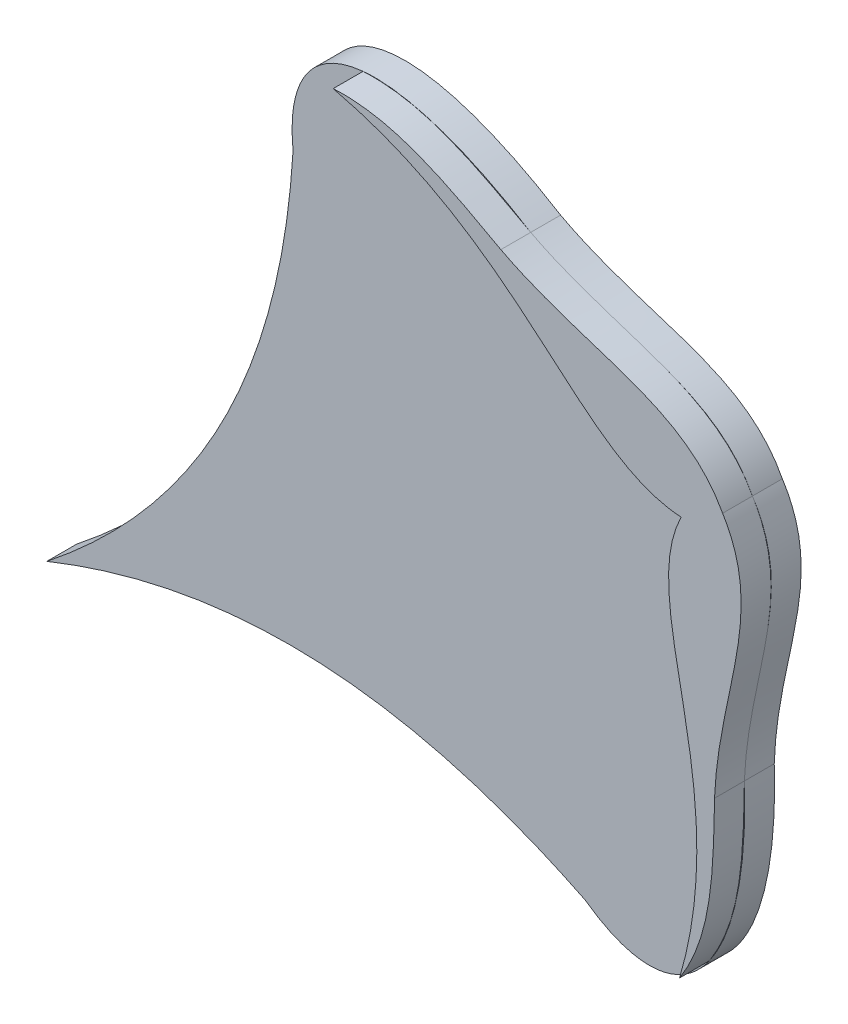
ISO-10303-21;
HEADER;
FILE_DESCRIPTION(('STEP AP214'),'2;1');
FILE_NAME('part.step','',(''),(''),'','','');
FILE_SCHEMA(('AUTOMOTIVE_DESIGN { 1 0 10303 214 1 1 1 1 }'));
ENDSEC;
DATA;
#1=APPLICATION_CONTEXT('core data for automotive mechanical design processes');
#2=APPLICATION_PROTOCOL_DEFINITION('international standard','automotive_design',2000,#1);
#3=PRODUCT_CONTEXT('',#1,'mechanical');
#4=PRODUCT('Part','Part','',(#3));
#5=PRODUCT_RELATED_PRODUCT_CATEGORY('part','',(#4));
#6=PRODUCT_DEFINITION_FORMATION('','',#4);
#7=PRODUCT_DEFINITION_CONTEXT('part definition',#1,'design');
#8=PRODUCT_DEFINITION('design','',#6,#7);
#9=PRODUCT_DEFINITION_SHAPE('','',#8);
#10=(LENGTH_UNIT() NAMED_UNIT(*) SI_UNIT(.MILLI.,.METRE.));
#11=(NAMED_UNIT(*) PLANE_ANGLE_UNIT() SI_UNIT($,.RADIAN.));
#12=(NAMED_UNIT(*) SI_UNIT($,.STERADIAN.) SOLID_ANGLE_UNIT());
#13=UNCERTAINTY_MEASURE_WITH_UNIT(LENGTH_MEASURE(1.E-05),#10,'distance_accuracy_value','');
#14=(GEOMETRIC_REPRESENTATION_CONTEXT(3) GLOBAL_UNCERTAINTY_ASSIGNED_CONTEXT((#13)) GLOBAL_UNIT_ASSIGNED_CONTEXT((#10,
#11,#12)) REPRESENTATION_CONTEXT('',''));
#15=CARTESIAN_POINT('',(0.,0.,0.));
#16=DIRECTION('',(0.,0.,1.));
#17=DIRECTION('',(1.,0.,0.));
#18=AXIS2_PLACEMENT_3D('',#15,#16,#17);
#19=CARTESIAN_POINT('',(1257.68562303942,896.329565839617,10.));
#20=DIRECTION('',(0.,0.,1.));
#21=DIRECTION('',(1.,0.,0.));
#22=AXIS2_PLACEMENT_3D('',#19,#20,#21);
#23=PLANE('',#22);
#24=CARTESIAN_POINT('',(1252.95578789732,934.562229178252,10.));
#25=CARTESIAN_POINT('',(1239.68948050402,959.235382945846,10.));
#26=CARTESIAN_POINT('',(1207.93242203247,958.685651362932,10.));
#27=CARTESIAN_POINT('',(1178.69199211024,973.903346263691,10.));
#28=B_SPLINE_CURVE_WITH_KNOTS('',3,(#24,#25,#26,#27),.UNSPECIFIED.,.F.,.F.,(4,4),(0.,1.),.UNSPECIFIED.);
#29=CARTESIAN_POINT('',(1252.95578789732,934.562229178252,10.));
#30=VERTEX_POINT('',#29);
#31=CARTESIAN_POINT('',(1224.52982696289,956.755619374722,10.));
#32=VERTEX_POINT('',#31);
#33=EDGE_CURVE('E295',#30,#32,#28,.T.);
#34=ORIENTED_EDGE('',*,*,#33,.F.);
#35=CARTESIAN_POINT('',(1252.95578789732,934.562229178252,10.));
#36=CARTESIAN_POINT('',(1240.05530375808,959.428610854444,10.));
#37=CARTESIAN_POINT('',(1208.36518699982,958.1394614786,10.));
#38=CARTESIAN_POINT('',(1178.69199211024,973.903346263691,10.));
#39=B_SPLINE_CURVE_WITH_KNOTS('',3,(#35,#36,#37,#38),.UNSPECIFIED.,.F.,.F.,(4,4),(0.,1.),.UNSPECIFIED.);
#40=EDGE_CURVE('E166',#30,#32,#39,.T.);
#41=ORIENTED_EDGE('',*,*,#40,.T.);
#42=EDGE_LOOP('',(#34,#41));
#43=FACE_BOUND('',#42,.T.);
#44=ADVANCED_FACE('F33',(#43),#23,.T.);
#45=CARTESIAN_POINT('',(1250.24476772603,850.565293353981,10.));
#46=CARTESIAN_POINT('',(1251.54864503955,883.502823377961,10.));
#47=CARTESIAN_POINT('',(1267.78950083673,910.798382917091,10.));
#48=CARTESIAN_POINT('',(1252.95578789732,934.562229178252,10.));
#49=B_SPLINE_CURVE_WITH_KNOTS('',3,(#45,#46,#47,#48),.UNSPECIFIED.,.F.,.F.,(4,4),(0.,1.),.UNSPECIFIED.);
#50=CARTESIAN_POINT('',(1258.1118288159,898.869133690609,10.));
#51=VERTEX_POINT('',#50);
#52=EDGE_CURVE('E11',#51,#30,#49,.T.);
#53=ORIENTED_EDGE('',*,*,#52,.F.);
#54=CARTESIAN_POINT('',(1250.24476772603,850.565293353981,10.));
#55=CARTESIAN_POINT('',(1251.28931202789,884.149627286253,10.));
#56=CARTESIAN_POINT('',(1268.13883086945,911.020040775314,10.));
#57=CARTESIAN_POINT('',(1252.95578789732,934.562229178252,10.));
#58=B_SPLINE_CURVE_WITH_KNOTS('',3,(#54,#55,#56,#57),.UNSPECIFIED.,.F.,.F.,(4,4),(0.,1.),.UNSPECIFIED.);
#59=EDGE_CURVE('E165',#51,#30,#58,.T.);
#60=ORIENTED_EDGE('',*,*,#59,.T.);
#61=EDGE_LOOP('',(#53,#60));
#62=FACE_BOUND('',#61,.T.);
#63=ADVANCED_FACE('F364',(#62),#23,.T.);
#64=CARTESIAN_POINT('',(1238.54053740899,792.57912942456,10.));
#65=CARTESIAN_POINT('',(1249.54286084366,809.642956465323,10.));
#66=CARTESIAN_POINT('',(1249.85361849632,828.950841043679,10.));
#67=CARTESIAN_POINT('',(1250.24476772603,850.565293353981,10.));
#68=B_SPLINE_CURVE_WITH_KNOTS('',3,(#64,#65,#66,#67),.UNSPECIFIED.,.F.,.F.,(4,4),(0.,1.),.UNSPECIFIED.);
#69=CARTESIAN_POINT('',(1238.54053740899,792.579129424561,10.));
#70=VERTEX_POINT('',#69);
#71=CARTESIAN_POINT('',(1250.24476772603,850.565293353981,10.));
#72=VERTEX_POINT('',#71);
#73=EDGE_CURVE('E58',#70,#72,#68,.T.);
#74=ORIENTED_EDGE('',*,*,#73,.F.);
#75=CARTESIAN_POINT('',(1196.82046500494,789.441587825969,10.));
#76=CARTESIAN_POINT('',(1228.4854729591,766.649506486911,10.));
#77=CARTESIAN_POINT('',(1252.21483787203,792.172363040948,10.));
#78=CARTESIAN_POINT('',(1250.24476772603,850.565293353981,10.));
#79=B_SPLINE_CURVE_WITH_KNOTS('',3,(#75,#76,#77,#78),.UNSPECIFIED.,.F.,.F.,(4,4),(0.,1.),.UNSPECIFIED.);
#80=EDGE_CURVE('E211',#70,#72,#79,.T.);
#81=ORIENTED_EDGE('',*,*,#80,.T.);
#82=EDGE_LOOP('',(#74,#81));
#83=FACE_BOUND('',#82,.T.);
#84=ADVANCED_FACE('F427',(#83),#23,.T.);
#85=CARTESIAN_POINT('',(1239.04685966227,926.493166974167,10.));
#86=CARTESIAN_POINT('',(1223.64918540165,895.028097143513,10.));
#87=CARTESIAN_POINT('',(1257.09902681844,855.762298455026,10.));
#88=CARTESIAN_POINT('',(1238.54053740899,792.57912942456,10.));
#89=B_SPLINE_CURVE_WITH_KNOTS('',3,(#85,#86,#87,#88),.UNSPECIFIED.,.F.,.F.,(4,4),(0.,1.),.UNSPECIFIED.);
#90=CARTESIAN_POINT('',(1239.04685966227,926.493166974167,10.));
#91=VERTEX_POINT('',#90);
#92=EDGE_CURVE('E51',#91,#70,#89,.T.);
#93=ORIENTED_EDGE('',*,*,#92,.F.);
#94=CARTESIAN_POINT('',(1122.54418966289,992.526141298193,10.));
#95=CARTESIAN_POINT('',(1186.6058648403,977.273857818117,10.));
#96=CARTESIAN_POINT('',(1204.08877184112,928.745074603891,10.));
#97=CARTESIAN_POINT('',(1239.04685966227,926.493166974167,10.));
#98=B_SPLINE_CURVE_WITH_KNOTS('',3,(#94,#95,#96,#97),.UNSPECIFIED.,.F.,.F.,(4,4),(0.,1.),.UNSPECIFIED.);
#99=CARTESIAN_POINT('',(1122.54418966289,992.526141298193,10.));
#100=VERTEX_POINT('',#99);
#101=EDGE_CURVE('E309',#100,#91,#98,.T.);
#102=ORIENTED_EDGE('',*,*,#101,.F.);
#103=CARTESIAN_POINT('',(1178.69199211024,973.903346263691,10.));
#104=CARTESIAN_POINT('',(1128.978750358,1004.59877070132,10.));
#105=CARTESIAN_POINT('',(1095.04342185862,996.66829495973,10.));
#106=CARTESIAN_POINT('',(1099.11138451725,957.866189600466,10.));
#107=B_SPLINE_CURVE_WITH_KNOTS('',3,(#103,#104,#105,#106),.UNSPECIFIED.,.F.,.F.,(4,4),(0.,1.),.UNSPECIFIED.);
#108=CARTESIAN_POINT('',(1099.11138451725,957.866189600466,10.));
#109=VERTEX_POINT('',#108);
#110=EDGE_CURVE('E175',#100,#109,#107,.T.);
#111=ORIENTED_EDGE('',*,*,#110,.T.);
#112=CARTESIAN_POINT('',(1099.11138451725,957.866189600466,10.));
#113=CARTESIAN_POINT('',(1095.49017488821,897.857572890637,10.));
#114=CARTESIAN_POINT('',(1073.11801374348,842.106722885175,10.));
#115=CARTESIAN_POINT('',(1016.64593410162,797.470508127469,10.));
#116=B_SPLINE_CURVE_WITH_KNOTS('',3,(#112,#113,#114,#115),.UNSPECIFIED.,.F.,.F.,(4,4),(0.,1.),.UNSPECIFIED.);
#117=CARTESIAN_POINT('',(1016.64593410162,797.470508127469,10.));
#118=VERTEX_POINT('',#117);
#119=EDGE_CURVE('E199',#109,#118,#116,.T.);
#120=ORIENTED_EDGE('',*,*,#119,.T.);
#121=CARTESIAN_POINT('',(1016.64593410162,797.470508127469,10.));
#122=CARTESIAN_POINT('',(1083.42654295921,824.337546065837,10.));
#123=CARTESIAN_POINT('',(1142.92922856485,816.08519631962,10.));
#124=CARTESIAN_POINT('',(1196.82046500494,789.441587825969,10.));
#125=B_SPLINE_CURVE_WITH_KNOTS('',3,(#121,#122,#123,#124),.UNSPECIFIED.,.F.,.F.,(4,4),(0.,1.),.UNSPECIFIED.);
#126=CARTESIAN_POINT('',(1196.82046500494,789.441587825969,10.));
#127=VERTEX_POINT('',#126);
#128=EDGE_CURVE('E203',#118,#127,#125,.T.);
#129=ORIENTED_EDGE('',*,*,#128,.T.);
#130=EDGE_CURVE('E212',#127,#70,#79,.T.);
#131=ORIENTED_EDGE('',*,*,#130,.T.);
#132=EDGE_LOOP('',(#93,#102,#111,#120,#129,#131));
#133=FACE_BOUND('',#132,.T.);
#134=ADVANCED_FACE('F239',(#133),#23,.T.);
#135=DIRECTION('',(0.,0.,-1.));
#136=VECTOR('',#135,1.);
#137=SURFACE_OF_LINEAR_EXTRUSION('',#58,#136);
#138=CARTESIAN_POINT('',(1250.24476772603,850.565293353981,0.));
#139=CARTESIAN_POINT('',(1251.28931202789,884.149627286253,0.));
#140=CARTESIAN_POINT('',(1268.13883086945,911.020040775314,0.));
#141=CARTESIAN_POINT('',(1252.95578789732,934.562229178252,0.));
#142=B_SPLINE_CURVE_WITH_KNOTS('',3,(#138,#139,#140,#141),.UNSPECIFIED.,.F.,.F.,(4,4),(0.,1.),.UNSPECIFIED.);
#143=CARTESIAN_POINT('',(1250.24476772603,850.565293353981,0.));
#144=VERTEX_POINT('',#143);
#145=CARTESIAN_POINT('',(1252.95578789732,934.562229178252,0.));
#146=VERTEX_POINT('',#145);
#147=EDGE_CURVE('E150',#144,#146,#142,.T.);
#148=ORIENTED_EDGE('',*,*,#147,.T.);
#149=DIRECTION('',(0.,0.,-1.));
#150=VECTOR('',#149,1.);
#151=CARTESIAN_POINT('',(1252.95578789732,934.562229178252,10.));
#152=LINE('',#151,#150);
#153=EDGE_CURVE('E38',#30,#146,#152,.T.);
#154=ORIENTED_EDGE('',*,*,#153,.F.);
#155=ORIENTED_EDGE('',*,*,#59,.F.);
#156=EDGE_CURVE('E158',#72,#51,#58,.T.);
#157=ORIENTED_EDGE('',*,*,#156,.F.);
#158=DIRECTION('',(0.,0.,-1.));
#159=VECTOR('',#158,1.);
#160=CARTESIAN_POINT('',(1250.24476772603,850.565293353981,10.));
#161=LINE('',#160,#159);
#162=EDGE_CURVE('E219',#72,#144,#161,.T.);
#163=ORIENTED_EDGE('',*,*,#162,.T.);
#164=EDGE_LOOP('',(#148,#154,#155,#157,#163));
#165=FACE_BOUND('',#164,.T.);
#166=ADVANCED_FACE('F35',(#165),#137,.F.);
#167=DIRECTION('',(0.,0.,-1.));
#168=VECTOR('',#167,1.);
#169=SURFACE_OF_LINEAR_EXTRUSION('',#39,#168);
#170=CARTESIAN_POINT('',(1252.95578789732,934.562229178252,0.));
#171=CARTESIAN_POINT('',(1240.05530375808,959.428610854444,0.));
#172=CARTESIAN_POINT('',(1208.36518699982,958.1394614786,0.));
#173=CARTESIAN_POINT('',(1178.69199211024,973.903346263691,0.));
#174=B_SPLINE_CURVE_WITH_KNOTS('',3,(#170,#171,#172,#173),.UNSPECIFIED.,.F.,.F.,(4,4),(0.,1.),.UNSPECIFIED.);
#175=CARTESIAN_POINT('',(1178.69199211024,973.903346263691,0.));
#176=VERTEX_POINT('',#175);
#177=EDGE_CURVE('E153',#146,#176,#174,.T.);
#178=ORIENTED_EDGE('',*,*,#177,.T.);
#179=DIRECTION('',(0.,0.,-1.));
#180=VECTOR('',#179,1.);
#181=CARTESIAN_POINT('',(1178.69199211024,973.903346263691,10.));
#182=LINE('',#181,#180);
#183=CARTESIAN_POINT('',(1178.69199211024,973.903346263691,10.));
#184=VERTEX_POINT('',#183);
#185=EDGE_CURVE('E352',#184,#176,#182,.T.);
#186=ORIENTED_EDGE('',*,*,#185,.F.);
#187=EDGE_CURVE('E164',#32,#184,#39,.T.);
#188=ORIENTED_EDGE('',*,*,#187,.F.);
#189=ORIENTED_EDGE('',*,*,#40,.F.);
#190=ORIENTED_EDGE('',*,*,#153,.T.);
#191=EDGE_LOOP('',(#178,#186,#188,#189,#190));
#192=FACE_BOUND('',#191,.T.);
#193=ADVANCED_FACE('F184',(#192),#169,.F.);
#194=DIRECTION('',(0.,0.,-1.));
#195=VECTOR('',#194,1.);
#196=SURFACE_OF_LINEAR_EXTRUSION('',#107,#195);
#197=CARTESIAN_POINT('',(1178.69199211024,973.903346263691,0.));
#198=CARTESIAN_POINT('',(1128.978750358,1004.59877070132,0.));
#199=CARTESIAN_POINT('',(1095.04342185862,996.66829495973,0.));
#200=CARTESIAN_POINT('',(1099.11138451725,957.866189600466,0.));
#201=B_SPLINE_CURVE_WITH_KNOTS('',3,(#197,#198,#199,#200),.UNSPECIFIED.,.F.,.F.,(4,4),(0.,1.),.UNSPECIFIED.);
#202=CARTESIAN_POINT('',(1099.11138451725,957.866189600466,0.));
#203=VERTEX_POINT('',#202);
#204=EDGE_CURVE('E382',#176,#203,#201,.T.);
#205=ORIENTED_EDGE('',*,*,#204,.T.);
#206=DIRECTION('',(0.,0.,-1.));
#207=VECTOR('',#206,1.);
#208=CARTESIAN_POINT('',(1099.11138451725,957.866189600466,10.));
#209=LINE('',#208,#207);
#210=EDGE_CURVE('E357',#109,#203,#209,.T.);
#211=ORIENTED_EDGE('',*,*,#210,.F.);
#212=ORIENTED_EDGE('',*,*,#110,.F.);
#213=EDGE_CURVE('E176',#184,#100,#107,.T.);
#214=ORIENTED_EDGE('',*,*,#213,.F.);
#215=ORIENTED_EDGE('',*,*,#185,.T.);
#216=EDGE_LOOP('',(#205,#211,#212,#214,#215));
#217=FACE_BOUND('',#216,.T.);
#218=ADVANCED_FACE('F187',(#217),#196,.F.);
#219=DIRECTION('',(0.,0.,-1.));
#220=VECTOR('',#219,1.);
#221=SURFACE_OF_LINEAR_EXTRUSION('',#116,#220);
#222=CARTESIAN_POINT('',(1099.11138451725,957.866189600466,0.));
#223=CARTESIAN_POINT('',(1095.49017488821,897.857572890637,0.));
#224=CARTESIAN_POINT('',(1073.11801374348,842.106722885175,0.));
#225=CARTESIAN_POINT('',(1016.64593410162,797.470508127469,0.));
#226=B_SPLINE_CURVE_WITH_KNOTS('',3,(#222,#223,#224,#225),.UNSPECIFIED.,.F.,.F.,(4,4),(0.,1.),.UNSPECIFIED.);
#227=CARTESIAN_POINT('',(1016.64593410162,797.470508127469,0.));
#228=VERTEX_POINT('',#227);
#229=EDGE_CURVE('E383',#203,#228,#226,.T.);
#230=ORIENTED_EDGE('',*,*,#229,.T.);
#231=DIRECTION('',(0.,0.,-1.));
#232=VECTOR('',#231,1.);
#233=CARTESIAN_POINT('',(1016.64593410162,797.470508127469,10.));
#234=LINE('',#233,#232);
#235=EDGE_CURVE('E417',#118,#228,#234,.T.);
#236=ORIENTED_EDGE('',*,*,#235,.F.);
#237=ORIENTED_EDGE('',*,*,#119,.F.);
#238=ORIENTED_EDGE('',*,*,#210,.T.);
#239=EDGE_LOOP('',(#230,#236,#237,#238));
#240=FACE_BOUND('',#239,.T.);
#241=ADVANCED_FACE('F191',(#240),#221,.F.);
#242=DIRECTION('',(0.,0.,-1.));
#243=VECTOR('',#242,1.);
#244=SURFACE_OF_LINEAR_EXTRUSION('',#125,#243);
#245=CARTESIAN_POINT('',(1016.64593410162,797.470508127469,0.));
#246=CARTESIAN_POINT('',(1083.42654295921,824.337546065837,0.));
#247=CARTESIAN_POINT('',(1142.92922856485,816.08519631962,0.));
#248=CARTESIAN_POINT('',(1196.82046500494,789.441587825969,0.));
#249=B_SPLINE_CURVE_WITH_KNOTS('',3,(#245,#246,#247,#248),.UNSPECIFIED.,.F.,.F.,(4,4),(0.,1.),.UNSPECIFIED.);
#250=CARTESIAN_POINT('',(1196.82046500494,789.441587825969,0.));
#251=VERTEX_POINT('',#250);
#252=EDGE_CURVE('E399',#228,#251,#249,.T.);
#253=ORIENTED_EDGE('',*,*,#252,.T.);
#254=DIRECTION('',(0.,0.,-1.));
#255=VECTOR('',#254,1.);
#256=CARTESIAN_POINT('',(1196.82046500494,789.441587825969,10.));
#257=LINE('',#256,#255);
#258=EDGE_CURVE('E377',#127,#251,#257,.T.);
#259=ORIENTED_EDGE('',*,*,#258,.F.);
#260=ORIENTED_EDGE('',*,*,#128,.F.);
#261=ORIENTED_EDGE('',*,*,#235,.T.);
#262=EDGE_LOOP('',(#253,#259,#260,#261));
#263=FACE_BOUND('',#262,.T.);
#264=ADVANCED_FACE('F195',(#263),#244,.F.);
#265=DIRECTION('',(0.,0.,-1.));
#266=VECTOR('',#265,1.);
#267=SURFACE_OF_LINEAR_EXTRUSION('',#79,#266);
#268=CARTESIAN_POINT('',(1196.82046500494,789.441587825969,0.));
#269=CARTESIAN_POINT('',(1228.4854729591,766.649506486911,0.));
#270=CARTESIAN_POINT('',(1252.21483787203,792.172363040948,0.));
#271=CARTESIAN_POINT('',(1250.24476772603,850.565293353981,0.));
#272=B_SPLINE_CURVE_WITH_KNOTS('',3,(#268,#269,#270,#271),.UNSPECIFIED.,.F.,.F.,(4,4),(0.,1.),.UNSPECIFIED.);
#273=EDGE_CURVE('E368',#251,#144,#272,.T.);
#274=ORIENTED_EDGE('',*,*,#273,.T.);
#275=ORIENTED_EDGE('',*,*,#162,.F.);
#276=ORIENTED_EDGE('',*,*,#80,.F.);
#277=ORIENTED_EDGE('',*,*,#130,.F.);
#278=ORIENTED_EDGE('',*,*,#258,.T.);
#279=EDGE_LOOP('',(#274,#275,#276,#277,#278));
#280=FACE_BOUND('',#279,.T.);
#281=ADVANCED_FACE('F226',(#280),#267,.F.);
#282=CARTESIAN_POINT('',(1178.69199211024,973.903346263691,10.));
#283=CARTESIAN_POINT('',(1159.73423547592,984.292812553552,10.));
#284=CARTESIAN_POINT('',(1142.81872494729,993.607128457887,10.));
#285=CARTESIAN_POINT('',(1122.54418966289,992.526141298193,10.));
#286=B_SPLINE_CURVE_WITH_KNOTS('',3,(#282,#283,#284,#285),.UNSPECIFIED.,.F.,.F.,(4,4),(0.,1.),.UNSPECIFIED.);
#287=EDGE_CURVE('E302',#184,#100,#286,.T.);
#288=ORIENTED_EDGE('',*,*,#287,.F.);
#289=ORIENTED_EDGE('',*,*,#213,.T.);
#290=EDGE_LOOP('',(#288,#289));
#291=FACE_BOUND('',#290,.T.);
#292=ADVANCED_FACE('F229',(#291),#23,.T.);
#293=CARTESIAN_POINT('',(1257.68562303942,896.329565839617,0.));
#294=DIRECTION('',(0.,0.,1.));
#295=DIRECTION('',(1.,0.,0.));
#296=AXIS2_PLACEMENT_3D('',#293,#294,#295);
#297=PLANE('',#296);
#298=ORIENTED_EDGE('',*,*,#147,.F.);
#299=ORIENTED_EDGE('',*,*,#273,.F.);
#300=ORIENTED_EDGE('',*,*,#252,.F.);
#301=ORIENTED_EDGE('',*,*,#229,.F.);
#302=ORIENTED_EDGE('',*,*,#204,.F.);
#303=ORIENTED_EDGE('',*,*,#177,.F.);
#304=EDGE_LOOP('',(#298,#299,#300,#301,#302,#303));
#305=FACE_BOUND('',#304,.T.);
#306=ADVANCED_FACE('F231',(#305),#297,.F.);
#307=CARTESIAN_POINT('',(1221.81418595213,957.778584796035,10.));
#308=DIRECTION('',(0.,0.,-1.));
#309=DIRECTION('',(-1.,0.,0.));
#310=AXIS2_PLACEMENT_3D('',#307,#308,#309);
#311=PLANE('',#310);
#312=EDGE_CURVE('E44',#72,#51,#49,.T.);
#313=ORIENTED_EDGE('',*,*,#312,.F.);
#314=ORIENTED_EDGE('',*,*,#156,.T.);
#315=EDGE_LOOP('',(#313,#314));
#316=FACE_BOUND('',#315,.T.);
#317=ADVANCED_FACE('F234',(#316),#311,.T.);
#318=CARTESIAN_POINT('',(1252.95578789732,934.562229178252,20.));
#319=CARTESIAN_POINT('',(1239.68948050402,959.235382945846,20.));
#320=CARTESIAN_POINT('',(1207.93242203247,958.685651362932,20.));
#321=CARTESIAN_POINT('',(1178.69199211024,973.903346263691,20.));
#322=B_SPLINE_CURVE_WITH_KNOTS('',3,(#318,#319,#320,#321),.UNSPECIFIED.,.F.,.F.,(4,4),(0.,1.),.UNSPECIFIED.);
#323=DIRECTION('',(0.,0.,-1.));
#324=VECTOR('',#323,1.);
#325=SURFACE_OF_LINEAR_EXTRUSION('',#322,#324);
#326=ORIENTED_EDGE('',*,*,#33,.T.);
#327=EDGE_CURVE('E149',#32,#184,#28,.T.);
#328=ORIENTED_EDGE('',*,*,#327,.T.);
#329=DIRECTION('',(0.,0.,-1.));
#330=VECTOR('',#329,1.);
#331=CARTESIAN_POINT('',(1178.69199211024,973.903346263691,20.));
#332=LINE('',#331,#330);
#333=CARTESIAN_POINT('',(1178.69199211024,973.903346263691,20.));
#334=VERTEX_POINT('',#333);
#335=EDGE_CURVE('E129',#334,#184,#332,.T.);
#336=ORIENTED_EDGE('',*,*,#335,.F.);
#337=CARTESIAN_POINT('',(1252.95578789732,934.562229178252,20.));
#338=VERTEX_POINT('',#337);
#339=EDGE_CURVE('E135',#338,#334,#322,.T.);
#340=ORIENTED_EDGE('',*,*,#339,.F.);
#341=DIRECTION('',(0.,0.,-1.));
#342=VECTOR('',#341,1.);
#343=CARTESIAN_POINT('',(1252.95578789732,934.562229178252,20.));
#344=LINE('',#343,#342);
#345=EDGE_CURVE('E294',#338,#30,#344,.T.);
#346=ORIENTED_EDGE('',*,*,#345,.T.);
#347=EDGE_LOOP('',(#326,#328,#336,#340,#346));
#348=FACE_BOUND('',#347,.T.);
#349=ADVANCED_FACE('F147',(#348),#325,.F.);
#350=CARTESIAN_POINT('',(1178.69199211024,973.903346263691,20.));
#351=CARTESIAN_POINT('',(1159.73423547592,984.292812553552,20.));
#352=CARTESIAN_POINT('',(1142.81872494729,993.607128457887,20.));
#353=CARTESIAN_POINT('',(1122.54418966289,992.526141298193,20.));
#354=B_SPLINE_CURVE_WITH_KNOTS('',3,(#350,#351,#352,#353),.UNSPECIFIED.,.F.,.F.,(4,4),(0.,1.),.UNSPECIFIED.);
#355=DIRECTION('',(0.,0.,-1.));
#356=VECTOR('',#355,1.);
#357=SURFACE_OF_LINEAR_EXTRUSION('',#354,#356);
#358=ORIENTED_EDGE('',*,*,#287,.T.);
#359=DIRECTION('',(0.,0.,-1.));
#360=VECTOR('',#359,1.);
#361=CARTESIAN_POINT('',(1122.54418966289,992.526141298193,20.));
#362=LINE('',#361,#360);
#363=CARTESIAN_POINT('',(1122.54418966289,992.526141298193,20.));
#364=VERTEX_POINT('',#363);
#365=EDGE_CURVE('E131',#364,#100,#362,.T.);
#366=ORIENTED_EDGE('',*,*,#365,.F.);
#367=EDGE_CURVE('E124',#334,#364,#354,.T.);
#368=ORIENTED_EDGE('',*,*,#367,.F.);
#369=ORIENTED_EDGE('',*,*,#335,.T.);
#370=EDGE_LOOP('',(#358,#366,#368,#369));
#371=FACE_BOUND('',#370,.T.);
#372=ADVANCED_FACE('F127',(#371),#357,.F.);
#373=CARTESIAN_POINT('',(1122.54418966289,992.526141298193,20.));
#374=CARTESIAN_POINT('',(1186.6058648403,977.273857818117,20.));
#375=CARTESIAN_POINT('',(1204.08877184112,928.745074603891,20.));
#376=CARTESIAN_POINT('',(1239.04685966227,926.493166974167,20.));
#377=B_SPLINE_CURVE_WITH_KNOTS('',3,(#373,#374,#375,#376),.UNSPECIFIED.,.F.,.F.,(4,4),(0.,1.),.UNSPECIFIED.);
#378=DIRECTION('',(0.,0.,-1.));
#379=VECTOR('',#378,1.);
#380=SURFACE_OF_LINEAR_EXTRUSION('',#377,#379);
#381=ORIENTED_EDGE('',*,*,#101,.T.);
#382=DIRECTION('',(0.,0.,-1.));
#383=VECTOR('',#382,1.);
#384=CARTESIAN_POINT('',(1239.04685966227,926.493166974167,20.));
#385=LINE('',#384,#383);
#386=CARTESIAN_POINT('',(1239.04685966227,926.493166974167,20.));
#387=VERTEX_POINT('',#386);
#388=EDGE_CURVE('E155',#387,#91,#385,.T.);
#389=ORIENTED_EDGE('',*,*,#388,.F.);
#390=EDGE_CURVE('E134',#364,#387,#377,.T.);
#391=ORIENTED_EDGE('',*,*,#390,.F.);
#392=ORIENTED_EDGE('',*,*,#365,.T.);
#393=EDGE_LOOP('',(#381,#389,#391,#392));
#394=FACE_BOUND('',#393,.T.);
#395=ADVANCED_FACE('F268',(#394),#380,.F.);
#396=CARTESIAN_POINT('',(1239.04685966227,926.493166974167,20.));
#397=CARTESIAN_POINT('',(1223.64918540165,895.028097143513,20.));
#398=CARTESIAN_POINT('',(1257.09902681844,855.762298455026,20.));
#399=CARTESIAN_POINT('',(1238.54053740899,792.57912942456,20.));
#400=B_SPLINE_CURVE_WITH_KNOTS('',3,(#396,#397,#398,#399),.UNSPECIFIED.,.F.,.F.,(4,4),(0.,1.),.UNSPECIFIED.);
#401=DIRECTION('',(0.,0.,-1.));
#402=VECTOR('',#401,1.);
#403=SURFACE_OF_LINEAR_EXTRUSION('',#400,#402);
#404=ORIENTED_EDGE('',*,*,#92,.T.);
#405=DIRECTION('',(0.,0.,-1.));
#406=VECTOR('',#405,1.);
#407=CARTESIAN_POINT('',(1238.54053740899,792.57912942456,20.));
#408=LINE('',#407,#406);
#409=CARTESIAN_POINT('',(1238.54053740899,792.57912942456,20.));
#410=VERTEX_POINT('',#409);
#411=EDGE_CURVE('E341',#410,#70,#408,.T.);
#412=ORIENTED_EDGE('',*,*,#411,.F.);
#413=EDGE_CURVE('E260',#387,#410,#400,.T.);
#414=ORIENTED_EDGE('',*,*,#413,.F.);
#415=ORIENTED_EDGE('',*,*,#388,.T.);
#416=EDGE_LOOP('',(#404,#412,#414,#415));
#417=FACE_BOUND('',#416,.T.);
#418=ADVANCED_FACE('F271',(#417),#403,.F.);
#419=CARTESIAN_POINT('',(1238.54053740899,792.57912942456,20.));
#420=CARTESIAN_POINT('',(1249.54286084366,809.642956465323,20.));
#421=CARTESIAN_POINT('',(1249.85361849632,828.950841043679,20.));
#422=CARTESIAN_POINT('',(1250.24476772603,850.565293353981,20.));
#423=B_SPLINE_CURVE_WITH_KNOTS('',3,(#419,#420,#421,#422),.UNSPECIFIED.,.F.,.F.,(4,4),(0.,1.),.UNSPECIFIED.);
#424=DIRECTION('',(0.,0.,-1.));
#425=VECTOR('',#424,1.);
#426=SURFACE_OF_LINEAR_EXTRUSION('',#423,#425);
#427=ORIENTED_EDGE('',*,*,#73,.T.);
#428=DIRECTION('',(0.,0.,-1.));
#429=VECTOR('',#428,1.);
#430=CARTESIAN_POINT('',(1250.24476772603,850.565293353981,20.));
#431=LINE('',#430,#429);
#432=CARTESIAN_POINT('',(1250.24476772603,850.565293353981,20.));
#433=VERTEX_POINT('',#432);
#434=EDGE_CURVE('E338',#433,#72,#431,.T.);
#435=ORIENTED_EDGE('',*,*,#434,.F.);
#436=EDGE_CURVE('E283',#410,#433,#423,.T.);
#437=ORIENTED_EDGE('',*,*,#436,.F.);
#438=ORIENTED_EDGE('',*,*,#411,.T.);
#439=EDGE_LOOP('',(#427,#435,#437,#438));
#440=FACE_BOUND('',#439,.T.);
#441=ADVANCED_FACE('F275',(#440),#426,.F.);
#442=CARTESIAN_POINT('',(1250.24476772603,850.565293353981,20.));
#443=CARTESIAN_POINT('',(1251.54864503955,883.502823377961,20.));
#444=CARTESIAN_POINT('',(1267.78950083673,910.798382917091,20.));
#445=CARTESIAN_POINT('',(1252.95578789732,934.562229178252,20.));
#446=B_SPLINE_CURVE_WITH_KNOTS('',3,(#442,#443,#444,#445),.UNSPECIFIED.,.F.,.F.,(4,4),(0.,1.),.UNSPECIFIED.);
#447=DIRECTION('',(0.,0.,-1.));
#448=VECTOR('',#447,1.);
#449=SURFACE_OF_LINEAR_EXTRUSION('',#446,#448);
#450=ORIENTED_EDGE('',*,*,#312,.T.);
#451=ORIENTED_EDGE('',*,*,#52,.T.);
#452=ORIENTED_EDGE('',*,*,#345,.F.);
#453=EDGE_CURVE('E140',#433,#338,#446,.T.);
#454=ORIENTED_EDGE('',*,*,#453,.F.);
#455=ORIENTED_EDGE('',*,*,#434,.T.);
#456=EDGE_LOOP('',(#450,#451,#452,#454,#455));
#457=FACE_BOUND('',#456,.T.);
#458=ADVANCED_FACE('F279',(#457),#449,.F.);
#459=CARTESIAN_POINT('',(1221.81418595213,957.778584796035,20.));
#460=DIRECTION('',(0.,0.,-1.));
#461=DIRECTION('',(-1.,0.,0.));
#462=AXIS2_PLACEMENT_3D('',#459,#460,#461);
#463=PLANE('',#462);
#464=ORIENTED_EDGE('',*,*,#339,.T.);
#465=ORIENTED_EDGE('',*,*,#367,.T.);
#466=ORIENTED_EDGE('',*,*,#390,.T.);
#467=ORIENTED_EDGE('',*,*,#413,.T.);
#468=ORIENTED_EDGE('',*,*,#436,.T.);
#469=ORIENTED_EDGE('',*,*,#453,.T.);
#470=EDGE_LOOP('',(#464,#465,#466,#467,#468,#469));
#471=FACE_BOUND('',#470,.T.);
#472=ADVANCED_FACE('F138',(#471),#463,.F.);
#473=ORIENTED_EDGE('',*,*,#327,.F.);
#474=ORIENTED_EDGE('',*,*,#187,.T.);
#475=EDGE_LOOP('',(#473,#474));
#476=FACE_BOUND('',#475,.T.);
#477=ADVANCED_FACE('F359',(#476),#311,.T.);
#478=CLOSED_SHELL('',(#44,#63,#84,#134,#166,#193,#218,#241,#264,#281,#292,#306,#317,#349,#372,
#395,#418,#441,#458,#472,#477));
#479=MANIFOLD_SOLID_BREP('B2',#478);
#480=ADVANCED_BREP_SHAPE_REPRESENTATION('',(#18,#479),#14);
#481=SHAPE_DEFINITION_REPRESENTATION(#9,#480);
ENDSEC;
END-ISO-10303-21;
